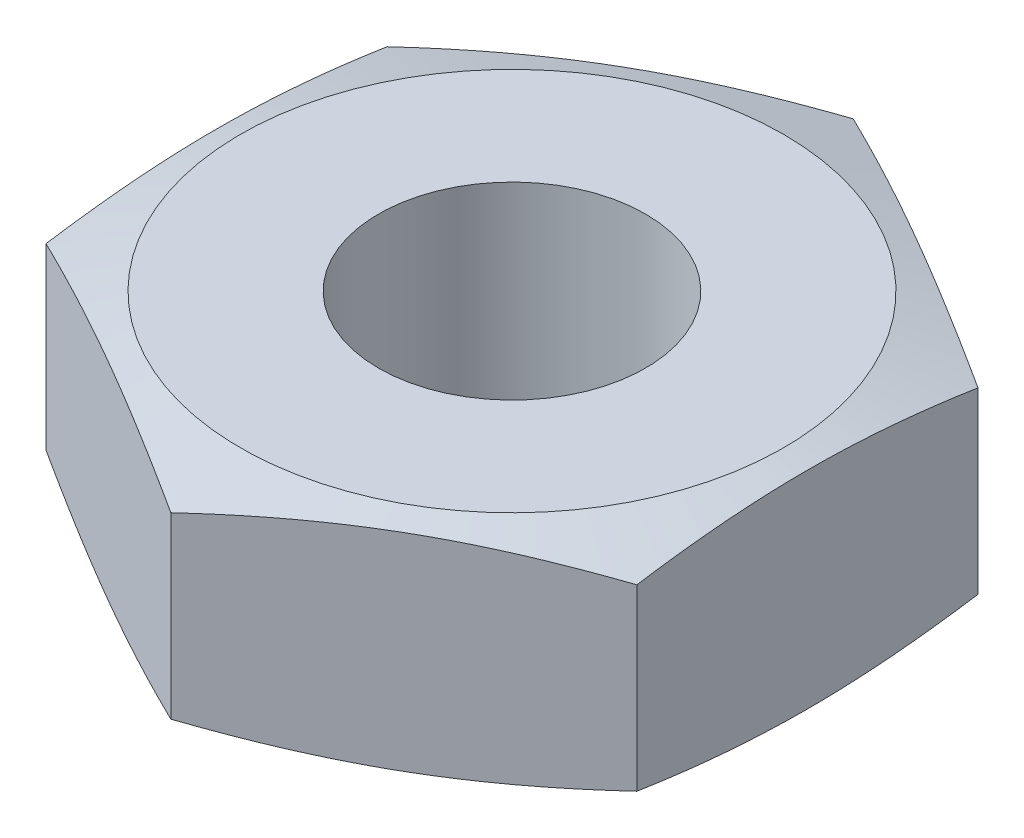
ISO-10303-21;
HEADER;
FILE_DESCRIPTION(('STEP AP214'),'2;1');
FILE_NAME('part.step','',(''),(''),'','','');
FILE_SCHEMA(('AUTOMOTIVE_DESIGN { 1 0 10303 214 1 1 1 1 }'));
ENDSEC;
DATA;
#1=APPLICATION_CONTEXT('core data for automotive mechanical design processes');
#2=APPLICATION_PROTOCOL_DEFINITION('international standard','automotive_design',2000,#1);
#3=PRODUCT_CONTEXT('',#1,'mechanical');
#4=PRODUCT('Part','Part','',(#3));
#5=PRODUCT_RELATED_PRODUCT_CATEGORY('part','',(#4));
#6=PRODUCT_DEFINITION_FORMATION('','',#4);
#7=PRODUCT_DEFINITION_CONTEXT('part definition',#1,'design');
#8=PRODUCT_DEFINITION('design','',#6,#7);
#9=PRODUCT_DEFINITION_SHAPE('','',#8);
#10=(LENGTH_UNIT() NAMED_UNIT(*) SI_UNIT(.MILLI.,.METRE.));
#11=(NAMED_UNIT(*) PLANE_ANGLE_UNIT() SI_UNIT($,.RADIAN.));
#12=(NAMED_UNIT(*) SI_UNIT($,.STERADIAN.) SOLID_ANGLE_UNIT());
#13=UNCERTAINTY_MEASURE_WITH_UNIT(LENGTH_MEASURE(1.E-05),#10,'distance_accuracy_value','');
#14=(GEOMETRIC_REPRESENTATION_CONTEXT(3) GLOBAL_UNCERTAINTY_ASSIGNED_CONTEXT((#13)) GLOBAL_UNIT_ASSIGNED_CONTEXT((#10,
#11,#12)) REPRESENTATION_CONTEXT('',''));
#15=CARTESIAN_POINT('',(0.,0.,0.));
#16=DIRECTION('',(0.,0.,1.));
#17=DIRECTION('',(1.,0.,0.));
#18=AXIS2_PLACEMENT_3D('',#15,#16,#17);
#19=CARTESIAN_POINT('',(0.,0.,0.));
#20=DIRECTION('',(0.,1.,0.));
#21=DIRECTION('',(0.,0.,1.));
#22=AXIS2_PLACEMENT_3D('',#19,#20,#21);
#23=PLANE('',#22);
#24=CARTESIAN_POINT('',(0.,0.,0.));
#25=DIRECTION('',(0.,1.,0.));
#26=DIRECTION('',(0.,0.,1.));
#27=AXIS2_PLACEMENT_3D('',#24,#25,#26);
#28=CIRCLE('',#27,1.4351);
#29=CARTESIAN_POINT('',(0.,0.,1.4351));
#30=VERTEX_POINT('',#29);
#31=EDGE_CURVE('E207',#30,#30,#28,.T.);
#32=ORIENTED_EDGE('',*,*,#31,.T.);
#33=EDGE_LOOP('',(#32));
#34=FACE_BOUND('',#33,.T.);
#35=CARTESIAN_POINT('',(0.,0.,0.));
#36=DIRECTION('',(0.,-1.,0.));
#37=DIRECTION('',(0.,0.,-1.));
#38=AXIS2_PLACEMENT_3D('',#35,#36,#37);
#39=CIRCLE('',#38,2.91823842374824);
#40=CARTESIAN_POINT('',(0.,0.,-2.91823842374824));
#41=VERTEX_POINT('',#40);
#42=EDGE_CURVE('E100',#41,#41,#39,.T.);
#43=ORIENTED_EDGE('',*,*,#42,.T.);
#44=EDGE_LOOP('',(#43));
#45=FACE_BOUND('',#44,.T.);
#46=ADVANCED_FACE('F35',(#34,#45),#23,.F.);
#47=CARTESIAN_POINT('',(0.,2.38125,0.));
#48=DIRECTION('',(0.,1.,0.));
#49=DIRECTION('',(0.,0.,1.));
#50=AXIS2_PLACEMENT_3D('',#47,#48,#49);
#51=PLANE('',#50);
#52=CARTESIAN_POINT('',(0.,2.38125,0.));
#53=DIRECTION('',(0.,1.,0.));
#54=DIRECTION('',(0.,0.,1.));
#55=AXIS2_PLACEMENT_3D('',#52,#53,#54);
#56=CIRCLE('',#55,1.4351);
#57=CARTESIAN_POINT('',(0.,2.38125,1.4351));
#58=VERTEX_POINT('',#57);
#59=EDGE_CURVE('E208',#58,#58,#56,.T.);
#60=ORIENTED_EDGE('',*,*,#59,.F.);
#61=EDGE_LOOP('',(#60));
#62=FACE_BOUND('',#61,.T.);
#63=CARTESIAN_POINT('',(0.,2.38125,0.));
#64=DIRECTION('',(0.,-1.,0.));
#65=DIRECTION('',(0.,0.,-1.));
#66=AXIS2_PLACEMENT_3D('',#63,#64,#65);
#67=CIRCLE('',#66,2.91823842374824);
#68=CARTESIAN_POINT('',(0.,2.38125,-2.91823842374824));
#69=VERTEX_POINT('',#68);
#70=EDGE_CURVE('E220',#69,#69,#67,.T.);
#71=ORIENTED_EDGE('',*,*,#70,.F.);
#72=EDGE_LOOP('',(#71));
#73=FACE_BOUND('',#72,.T.);
#74=ADVANCED_FACE('F228',(#62,#73),#51,.T.);
#75=CARTESIAN_POINT('',(-3.175,2.38125,1.83308710467706));
#76=DIRECTION('',(0.5,0.,-0.866025403784439));
#77=DIRECTION('',(-0.866025403784439,0.,-0.5));
#78=AXIS2_PLACEMENT_3D('',#75,#76,#77);
#79=PLANE('',#78);
#80=DIRECTION('',(0.,-1.,0.));
#81=VECTOR('',#80,1.);
#82=CARTESIAN_POINT('',(-3.175,2.38125,1.83308710467706));
#83=LINE('',#82,#81);
#84=CARTESIAN_POINT('',(-3.175,2.15147490433856,1.83308710467706));
#85=VERTEX_POINT('',#84);
#86=CARTESIAN_POINT('',(-3.175,0.229775095661449,1.83308710467706));
#87=VERTEX_POINT('',#86);
#88=EDGE_CURVE('E117',#85,#87,#83,.T.);
#89=ORIENTED_EDGE('',*,*,#88,.T.);
#90=CARTESIAN_POINT('',(-3.1752,0.229810571161652,1.83297163462322));
#91=CARTESIAN_POINT('',(-3.04347072029098,0.206435227969929,1.90902556972338));
#92=CARTESIAN_POINT('',(-2.91142913371932,0.185198107402909,1.98525981527476));
#93=CARTESIAN_POINT('',(-2.64673340273103,0.147867080272592,2.13808196681419));
#94=CARTESIAN_POINT('',(-2.51407896526072,0.131775965769645,2.21467004199687));
#95=CARTESIAN_POINT('',(-2.24921175176381,0.105719411660829,2.36759119900882));
#96=CARTESIAN_POINT('',(-2.11700206215993,0.0957132538636206,2.4439224988911));
#97=CARTESIAN_POINT('',(-1.85236153754915,0.0822945636551027,2.59671277701361));
#98=CARTESIAN_POINT('',(-1.71993076877457,0.0788803221892132,2.6731717170146));
#99=CARTESIAN_POINT('',(-1.45506923122543,0.0788803221892132,2.82608959701658));
#100=CARTESIAN_POINT('',(-1.32263846245085,0.0822945636551028,2.90254853701757));
#101=CARTESIAN_POINT('',(-1.05799793784007,0.0957132538636208,3.05533881514009));
#102=CARTESIAN_POINT('',(-0.925788248236195,0.105719411660829,3.13167011502237));
#103=CARTESIAN_POINT('',(-0.660921034739283,0.131775965769646,3.28459127203431));
#104=CARTESIAN_POINT('',(-0.528266597268968,0.147867080272592,3.361179347217));
#105=CARTESIAN_POINT('',(-0.263570866280681,0.18519810740291,3.51400149875643));
#106=CARTESIAN_POINT('',(-0.131529279709024,0.206435227969929,3.5902357443078));
#107=CARTESIAN_POINT('',(0.000199999999999788,0.229810571161653,3.66628967940796));
#108=B_SPLINE_CURVE_WITH_KNOTS('',3,(#90,#91,#92,#93,#94,#95,#96,#97,#98,#99,#100,#101,#102,
#103,#104,#105,#106,#107),.UNSPECIFIED.,.F.,.F.,(4,2,2,2,2,2,2,2,4),(0.,0.461713128028589,
0.923676343673619,1.38251325106804,1.84123118203172,2.2999491129954,2.75878602038983,
3.22074923603486,3.68246236406345),.UNSPECIFIED.);
#109=CARTESIAN_POINT('',(0.,0.22977509566145,3.66617420935412));
#110=VERTEX_POINT('',#109);
#111=EDGE_CURVE('E56',#87,#110,#108,.T.);
#112=ORIENTED_EDGE('',*,*,#111,.T.);
#113=DIRECTION('',(0.,-1.,0.));
#114=VECTOR('',#113,1.);
#115=CARTESIAN_POINT('',(0.,2.38125,3.66617420935412));
#116=LINE('',#115,#114);
#117=CARTESIAN_POINT('',(0.,2.15147490433856,3.66617420935412));
#118=VERTEX_POINT('',#117);
#119=EDGE_CURVE('E123',#118,#110,#116,.T.);
#120=ORIENTED_EDGE('',*,*,#119,.F.);
#121=CARTESIAN_POINT('',(0.000199999999999305,2.15143942883835,3.66628967940796));
#122=CARTESIAN_POINT('',(-0.131529279709024,2.17481477203008,3.5902357443078));
#123=CARTESIAN_POINT('',(-0.263570866280681,2.19605189259709,3.51400149875643));
#124=CARTESIAN_POINT('',(-0.528266597268968,2.23338291972741,3.361179347217));
#125=CARTESIAN_POINT('',(-0.660921034739283,2.24947403423036,3.28459127203431));
#126=CARTESIAN_POINT('',(-0.925788248236195,2.27553058833917,3.13167011502237));
#127=CARTESIAN_POINT('',(-1.05799793784007,2.28553674613638,3.05533881514009));
#128=CARTESIAN_POINT('',(-1.32263846245085,2.2989554363449,2.90254853701757));
#129=CARTESIAN_POINT('',(-1.45506923122543,2.30236967781079,2.82608959701658));
#130=CARTESIAN_POINT('',(-1.71993076877458,2.30236967781079,2.6731717170146));
#131=CARTESIAN_POINT('',(-1.85236153754915,2.2989554363449,2.59671277701361));
#132=CARTESIAN_POINT('',(-2.11700206215993,2.28553674613638,2.4439224988911));
#133=CARTESIAN_POINT('',(-2.24921175176381,2.27553058833917,2.36759119900882));
#134=CARTESIAN_POINT('',(-2.51407896526072,2.24947403423036,2.21467004199687));
#135=CARTESIAN_POINT('',(-2.64673340273103,2.23338291972741,2.13808196681419));
#136=CARTESIAN_POINT('',(-2.91142913371932,2.19605189259709,1.98525981527476));
#137=CARTESIAN_POINT('',(-3.04347072029098,2.17481477203008,1.90902556972338));
#138=CARTESIAN_POINT('',(-3.1752,2.15143942883835,1.83297163462322));
#139=B_SPLINE_CURVE_WITH_KNOTS('',3,(#121,#122,#123,#124,#125,#126,#127,#128,#129,#130,#131,
#132,#133,#134,#135,#136,#137,#138),.UNSPECIFIED.,.F.,.F.,(4,2,2,2,2,2,2,2,4),(0.,
0.46171312802859,0.923676343673619,1.38251325106804,1.84123118203172,2.2999491129954,
2.75878602038983,3.22074923603486,3.68246236406345),.UNSPECIFIED.);
#140=EDGE_CURVE('E197',#118,#85,#139,.T.);
#141=ORIENTED_EDGE('',*,*,#140,.T.);
#142=EDGE_LOOP('',(#89,#112,#120,#141));
#143=FACE_BOUND('',#142,.T.);
#144=ADVANCED_FACE('F37',(#143),#79,.F.);
#145=CARTESIAN_POINT('',(0.,2.38125,3.66617420935412));
#146=DIRECTION('',(-0.5,0.,-0.866025403784439));
#147=DIRECTION('',(-0.866025403784439,0.,0.5));
#148=AXIS2_PLACEMENT_3D('',#145,#146,#147);
#149=PLANE('',#148);
#150=ORIENTED_EDGE('',*,*,#119,.T.);
#151=CARTESIAN_POINT('',(-0.000200000000000749,0.229810571161653,3.66628967940796));
#152=CARTESIAN_POINT('',(0.131529279709023,0.206435227969929,3.5902357443078));
#153=CARTESIAN_POINT('',(0.26357086628068,0.18519810740291,3.51400149875643));
#154=CARTESIAN_POINT('',(0.528266597268967,0.147867080272592,3.361179347217));
#155=CARTESIAN_POINT('',(0.660921034739282,0.131775965769645,3.28459127203431));
#156=CARTESIAN_POINT('',(0.925788248236194,0.105719411660829,3.13167011502237));
#157=CARTESIAN_POINT('',(1.05799793784007,0.0957132538636205,3.05533881514009));
#158=CARTESIAN_POINT('',(1.32263846245085,0.0822945636551026,2.90254853701757));
#159=CARTESIAN_POINT('',(1.45506923122543,0.078880322189213,2.82608959701658));
#160=CARTESIAN_POINT('',(1.71993076877457,0.0788803221892129,2.6731717170146));
#161=CARTESIAN_POINT('',(1.85236153754915,0.0822945636551025,2.59671277701361));
#162=CARTESIAN_POINT('',(2.11700206215993,0.0957132538636203,2.44392249889109));
#163=CARTESIAN_POINT('',(2.24921175176381,0.105719411660829,2.36759119900882));
#164=CARTESIAN_POINT('',(2.51407896526072,0.131775965769645,2.21467004199687));
#165=CARTESIAN_POINT('',(2.64673340273103,0.147867080272592,2.13808196681419));
#166=CARTESIAN_POINT('',(2.91142913371932,0.185198107402909,1.98525981527475));
#167=CARTESIAN_POINT('',(3.04347072029098,0.206435227969928,1.90902556972338));
#168=CARTESIAN_POINT('',(3.1752,0.229810571161652,1.83297163462322));
#169=B_SPLINE_CURVE_WITH_KNOTS('',3,(#151,#152,#153,#154,#155,#156,#157,#158,#159,#160,#161,
#162,#163,#164,#165,#166,#167,#168),.UNSPECIFIED.,.F.,.F.,(4,2,2,2,2,2,2,2,4),(0.,
0.46171312802859,0.92367634367362,1.38251325106805,1.84123118203172,2.2999491129954,
2.75878602038983,3.22074923603486,3.68246236406345),.UNSPECIFIED.);
#170=CARTESIAN_POINT('',(3.175,0.229775095661449,1.83308710467706));
#171=VERTEX_POINT('',#170);
#172=EDGE_CURVE('E174',#110,#171,#169,.T.);
#173=ORIENTED_EDGE('',*,*,#172,.T.);
#174=DIRECTION('',(0.,-1.,0.));
#175=VECTOR('',#174,1.);
#176=CARTESIAN_POINT('',(3.175,2.38125,1.83308710467706));
#177=LINE('',#176,#175);
#178=CARTESIAN_POINT('',(3.175,2.15147490433856,1.83308710467706));
#179=VERTEX_POINT('',#178);
#180=EDGE_CURVE('E115',#179,#171,#177,.T.);
#181=ORIENTED_EDGE('',*,*,#180,.F.);
#182=CARTESIAN_POINT('',(3.1752,2.15143942883835,1.83297163462322));
#183=CARTESIAN_POINT('',(3.04347072029098,2.17481477203008,1.90902556972338));
#184=CARTESIAN_POINT('',(2.91142913371932,2.19605189259709,1.98525981527475));
#185=CARTESIAN_POINT('',(2.64673340273103,2.23338291972741,2.13808196681419));
#186=CARTESIAN_POINT('',(2.51407896526072,2.24947403423036,2.21467004199687));
#187=CARTESIAN_POINT('',(2.24921175176381,2.27553058833917,2.36759119900882));
#188=CARTESIAN_POINT('',(2.11700206215993,2.28553674613638,2.44392249889109));
#189=CARTESIAN_POINT('',(1.85236153754915,2.2989554363449,2.59671277701361));
#190=CARTESIAN_POINT('',(1.71993076877457,2.30236967781079,2.6731717170146));
#191=CARTESIAN_POINT('',(1.45506923122543,2.30236967781079,2.82608959701658));
#192=CARTESIAN_POINT('',(1.32263846245085,2.2989554363449,2.90254853701757));
#193=CARTESIAN_POINT('',(1.05799793784007,2.28553674613638,3.05533881514009));
#194=CARTESIAN_POINT('',(0.925788248236195,2.27553058833917,3.13167011502237));
#195=CARTESIAN_POINT('',(0.660921034739283,2.24947403423036,3.28459127203431));
#196=CARTESIAN_POINT('',(0.528266597268967,2.23338291972741,3.361179347217));
#197=CARTESIAN_POINT('',(0.26357086628068,2.19605189259709,3.51400149875643));
#198=CARTESIAN_POINT('',(0.131529279709024,2.17481477203008,3.5902357443078));
#199=CARTESIAN_POINT('',(-0.000199999999999806,2.15143942883835,3.66628967940796));
#200=B_SPLINE_CURVE_WITH_KNOTS('',3,(#182,#183,#184,#185,#186,#187,#188,#189,#190,#191,#192,
#193,#194,#195,#196,#197,#198,#199),.UNSPECIFIED.,.F.,.F.,(4,2,2,2,2,2,2,2,4),(0.,
0.46171312802859,0.923676343673619,1.38251325106804,1.84123118203172,2.2999491129954,
2.75878602038983,3.22074923603486,3.68246236406345),.UNSPECIFIED.);
#201=EDGE_CURVE('E190',#179,#118,#200,.T.);
#202=ORIENTED_EDGE('',*,*,#201,.T.);
#203=EDGE_LOOP('',(#150,#173,#181,#202));
#204=FACE_BOUND('',#203,.T.);
#205=ADVANCED_FACE('F182',(#204),#149,.F.);
#206=CARTESIAN_POINT('',(3.175,2.38125,1.83308710467706));
#207=DIRECTION('',(-1.,0.,0.));
#208=DIRECTION('',(0.,0.,1.));
#209=AXIS2_PLACEMENT_3D('',#206,#207,#208);
#210=PLANE('',#209);
#211=ORIENTED_EDGE('',*,*,#180,.T.);
#212=CARTESIAN_POINT('',(3.175,0.882498028858926,-4.84284838209254));
#213=CARTESIAN_POINT('',(3.175,0.845540450956629,-4.69896045540046));
#214=CARTESIAN_POINT('',(3.175,0.809028709215445,-4.55495598894786));
#215=CARTESIAN_POINT('',(3.175,0.73713997881131,-4.26665584852569));
#216=CARTESIAN_POINT('',(3.175,0.701763053935023,-4.12236015866968));
#217=CARTESIAN_POINT('',(3.175,0.632346095802565,-3.83324755787578));
#218=CARTESIAN_POINT('',(3.175,0.598307862474974,-3.68843021298746));
#219=CARTESIAN_POINT('',(3.175,0.531949077929729,-3.39840339671895));
#220=CARTESIAN_POINT('',(3.175,0.499628507893863,-3.25319392965305));
#221=CARTESIAN_POINT('',(3.175,0.437454196156556,-2.96387089117817));
#222=CARTESIAN_POINT('',(3.175,0.407577727683183,-2.81976225514172));
#223=CARTESIAN_POINT('',(3.175,0.350421882488817,-2.53103214177129));
#224=CARTESIAN_POINT('',(3.175,0.323142585134038,-2.38641064890505));
#225=CARTESIAN_POINT('',(3.175,0.246115500745554,-1.95171977178272));
#226=CARTESIAN_POINT('',(3.175,0.201160252258429,-1.66074213267588));
#227=CARTESIAN_POINT('',(3.175,0.147610508501762,-1.22030766375216));
#228=CARTESIAN_POINT('',(3.175,0.132010907382333,-1.07170073881368));
#229=CARTESIAN_POINT('',(3.175,0.106484281846803,-0.773993441648314));
#230=CARTESIAN_POINT('',(3.175,0.0965570727412833,-0.624893085646215));
#231=CARTESIAN_POINT('',(3.175,0.0829772445358877,-0.326493153784527));
#232=CARTESIAN_POINT('',(3.175,0.0793207849923239,-0.177193755942888));
#233=CARTESIAN_POINT('',(3.175,0.0785150973855896,0.121423152153427));
#234=CARTESIAN_POINT('',(3.175,0.0813658685575196,0.270740662405972));
#235=CARTESIAN_POINT('',(3.175,0.0934120979065997,0.569828401407168));
#236=CARTESIAN_POINT('',(3.175,0.102637791930309,0.71959738658901));
#237=CARTESIAN_POINT('',(3.175,0.126894565315699,1.01867337403518));
#238=CARTESIAN_POINT('',(3.175,0.141926340101328,1.16798031879835));
#239=CARTESIAN_POINT('',(3.175,0.177017570955498,1.46612406986226));
#240=CARTESIAN_POINT('',(3.175,0.197081365135513,1.6149603577177));
#241=CARTESIAN_POINT('',(3.175,0.241391749068005,1.91199750936059));
#242=CARTESIAN_POINT('',(3.175,0.265638258320237,2.06019838532089));
#243=CARTESIAN_POINT('',(3.175,0.339809615735374,2.48313370046352));
#244=CARTESIAN_POINT('',(3.175,0.393892302381207,2.7571352022586));
#245=CARTESIAN_POINT('',(3.175,0.509788370688865,3.3034975349043));
#246=CARTESIAN_POINT('',(3.175,0.571602977553403,3.57585809854592));
#247=CARTESIAN_POINT('',(3.175,0.700401117934673,4.11940090365494));
#248=CARTESIAN_POINT('',(3.175,0.767385649905057,4.39058290677428));
#249=CARTESIAN_POINT('',(3.175,0.904872680248803,4.93205405050345));
#250=CARTESIAN_POINT('',(3.175,0.975375268587398,5.2023431680914));
#251=CARTESIAN_POINT('',(3.175,1.11790589811358,5.73871832141435));
#252=CARTESIAN_POINT('',(3.175,1.18990175033281,6.00481294202591));
#253=CARTESIAN_POINT('',(3.175,1.33563742671576,6.53652945843044));
#254=CARTESIAN_POINT('',(3.175,1.40937729077384,6.80215134325982));
#255=CARTESIAN_POINT('',(3.175,1.5580369658754,7.3326419919057));
#256=CARTESIAN_POINT('',(3.175,1.63295487879459,7.59751128874055));
#257=CARTESIAN_POINT('',(3.175,1.78378297635461,8.12695565512506));
#258=CARTESIAN_POINT('',(3.175,1.85969312015137,8.39153073630235));
#259=CARTESIAN_POINT('',(3.175,1.93595574595595,8.65600298411708));
#260=B_SPLINE_CURVE_WITH_KNOTS('',3,(#212,#213,#214,#215,#216,#217,#218,#219,#220,#221,#222,
#223,#224,#225,#226,#227,#228,#229,#230,#231,#232,#233,#234,#235,#236,#237,#238,#239,#240,#241,
#242,#243,#244,#245,#246,#247,#248,#249,#250,#251,#252,#253,#254,#255,#256,#257,#258,#259),
.UNSPECIFIED.,.F.,.F.,(4,2,2,2,2,2,2,2,2,2,2,2,2,2,2,2,2,2,2,2,2,2,2,4),(0.,0.445677382769421,
0.891379772777596,1.33766225663657,1.78393985014783,2.22543420311392,2.66694204325312,
3.54970624815682,3.99788889099381,4.44605694046202,4.89395041675473,5.34184384039931,
5.79187630718249,6.24196269337618,6.6924384415769,7.14290552091956,7.98057217990627,
8.81837174439543,9.65633351768017,10.4943167306723,11.3212958977876,12.1482940004242,
12.9740738952841,13.7998199042316),.UNSPECIFIED.);
#261=CARTESIAN_POINT('',(3.175,0.229775095661447,-1.83308710467706));
#262=VERTEX_POINT('',#261);
#263=EDGE_CURVE('E110',#171,#262,#260,.F.);
#264=ORIENTED_EDGE('',*,*,#263,.T.);
#265=DIRECTION('',(0.,-1.,0.));
#266=VECTOR('',#265,1.);
#267=CARTESIAN_POINT('',(3.175,2.38125,-1.83308710467706));
#268=LINE('',#267,#266);
#269=CARTESIAN_POINT('',(3.175,2.15147490433855,-1.83308710467706));
#270=VERTEX_POINT('',#269);
#271=EDGE_CURVE('E109',#270,#262,#268,.T.);
#272=ORIENTED_EDGE('',*,*,#271,.F.);
#273=CARTESIAN_POINT('',(3.175,1.49875197114108,-4.84284838209254));
#274=CARTESIAN_POINT('',(3.175,1.53570954904337,-4.69896045540046));
#275=CARTESIAN_POINT('',(3.175,1.57222129078456,-4.55495598894786));
#276=CARTESIAN_POINT('',(3.175,1.64411002118869,-4.26665584852569));
#277=CARTESIAN_POINT('',(3.175,1.67948694606498,-4.12236015866968));
#278=CARTESIAN_POINT('',(3.175,1.74890390419744,-3.83324755787577));
#279=CARTESIAN_POINT('',(3.175,1.78294213752503,-3.68843021298746));
#280=CARTESIAN_POINT('',(3.175,1.84930092207027,-3.39840339671895));
#281=CARTESIAN_POINT('',(3.175,1.88162149210614,-3.25319392965304));
#282=CARTESIAN_POINT('',(3.175,1.94379580384345,-2.96387089117817));
#283=CARTESIAN_POINT('',(3.175,1.97367227231682,-2.81976225514172));
#284=CARTESIAN_POINT('',(3.175,2.03082811751118,-2.53103214177129));
#285=CARTESIAN_POINT('',(3.175,2.05810741486596,-2.38641064890505));
#286=CARTESIAN_POINT('',(3.175,2.13513449925445,-1.95171977178272));
#287=CARTESIAN_POINT('',(3.175,2.18008974774157,-1.66074213267588));
#288=CARTESIAN_POINT('',(3.175,2.23363949149824,-1.22030766375216));
#289=CARTESIAN_POINT('',(3.175,2.24923909261767,-1.07170073881368));
#290=CARTESIAN_POINT('',(3.175,2.2747657181532,-0.773993441648314));
#291=CARTESIAN_POINT('',(3.175,2.28469292725872,-0.624893085646215));
#292=CARTESIAN_POINT('',(3.175,2.29827275546411,-0.326493153784528));
#293=CARTESIAN_POINT('',(3.175,2.30192921500768,-0.17719375594289));
#294=CARTESIAN_POINT('',(3.175,2.30273490261441,0.121423152153425));
#295=CARTESIAN_POINT('',(3.175,2.29988413144248,0.270740662405971));
#296=CARTESIAN_POINT('',(3.175,2.2878379020934,0.569828401407167));
#297=CARTESIAN_POINT('',(3.175,2.27861220806969,0.719597386589008));
#298=CARTESIAN_POINT('',(3.175,2.2543554346843,1.01867337403517));
#299=CARTESIAN_POINT('',(3.175,2.23932365989867,1.16798031879835));
#300=CARTESIAN_POINT('',(3.175,2.20423242904451,1.46612406986226));
#301=CARTESIAN_POINT('',(3.175,2.18416863486449,1.6149603577177));
#302=CARTESIAN_POINT('',(3.175,2.139858250932,1.91199750936059));
#303=CARTESIAN_POINT('',(3.175,2.11561174167977,2.06019838532089));
#304=CARTESIAN_POINT('',(3.175,2.04144038426463,2.48313370046352));
#305=CARTESIAN_POINT('',(3.175,1.9873576976188,2.7571352022586));
#306=CARTESIAN_POINT('',(3.175,1.87146162931114,3.3034975349043));
#307=CARTESIAN_POINT('',(3.175,1.8096470224466,3.57585809854592));
#308=CARTESIAN_POINT('',(3.175,1.68084888206533,4.11940090365494));
#309=CARTESIAN_POINT('',(3.175,1.61386435009495,4.39058290677428));
#310=CARTESIAN_POINT('',(3.175,1.4763773197512,4.93205405050346));
#311=CARTESIAN_POINT('',(3.175,1.40587473141261,5.2023431680914));
#312=CARTESIAN_POINT('',(3.175,1.26334410188643,5.73871832141435));
#313=CARTESIAN_POINT('',(3.175,1.1913482496672,6.00481294202591));
#314=CARTESIAN_POINT('',(3.175,1.04561257328425,6.53652945843044));
#315=CARTESIAN_POINT('',(3.175,0.971872709226169,6.80215134325982));
#316=CARTESIAN_POINT('',(3.175,0.823213034124614,7.3326419919057));
#317=CARTESIAN_POINT('',(3.175,0.748295121205423,7.59751128874055));
#318=CARTESIAN_POINT('',(3.175,0.597467023645403,8.12695565512506));
#319=CARTESIAN_POINT('',(3.175,0.521556879848638,8.39153073630235));
#320=CARTESIAN_POINT('',(3.175,0.445294254044064,8.65600298411708));
#321=B_SPLINE_CURVE_WITH_KNOTS('',3,(#273,#274,#275,#276,#277,#278,#279,#280,#281,#282,#283,
#284,#285,#286,#287,#288,#289,#290,#291,#292,#293,#294,#295,#296,#297,#298,#299,#300,#301,#302,
#303,#304,#305,#306,#307,#308,#309,#310,#311,#312,#313,#314,#315,#316,#317,#318,#319,#320),
.UNSPECIFIED.,.F.,.F.,(4,2,2,2,2,2,2,2,2,2,2,2,2,2,2,2,2,2,2,2,2,2,2,4),(0.,0.445677382769421,
0.891379772777597,1.33766225663658,1.78393985014783,2.22543420311392,2.66694204325312,
3.54970624815682,3.99788889099381,4.44605694046202,4.89395041675472,5.34184384039931,
5.79187630718249,6.24196269337618,6.6924384415769,7.14290552091955,7.98057217990627,
8.81837174439542,9.65633351768017,10.4943167306723,11.3212958977876,12.1482940004242,
12.9740738952841,13.7998199042316),.UNSPECIFIED.);
#322=EDGE_CURVE('E198',#270,#179,#321,.T.);
#323=ORIENTED_EDGE('',*,*,#322,.T.);
#324=EDGE_LOOP('',(#211,#264,#272,#323));
#325=FACE_BOUND('',#324,.T.);
#326=ADVANCED_FACE('F185',(#325),#210,.F.);
#327=CARTESIAN_POINT('',(3.175,2.38125,-1.83308710467706));
#328=DIRECTION('',(-0.5,0.,0.866025403784439));
#329=DIRECTION('',(0.866025403784439,0.,0.5));
#330=AXIS2_PLACEMENT_3D('',#327,#328,#329);
#331=PLANE('',#330);
#332=ORIENTED_EDGE('',*,*,#271,.T.);
#333=CARTESIAN_POINT('',(3.1752,0.229810571161651,-1.83297163462322));
#334=CARTESIAN_POINT('',(3.04347072029098,0.206435227969927,-1.90902556972338));
#335=CARTESIAN_POINT('',(2.91142913371932,0.185198107402908,-1.98525981527476));
#336=CARTESIAN_POINT('',(2.64673340273103,0.14786708027259,-2.13808196681419));
#337=CARTESIAN_POINT('',(2.51407896526072,0.131775965769643,-2.21467004199687));
#338=CARTESIAN_POINT('',(2.24921175176381,0.105719411660827,-2.36759119900882));
#339=CARTESIAN_POINT('',(2.11700206215993,0.0957132538636186,-2.4439224988911));
#340=CARTESIAN_POINT('',(1.85236153754915,0.0822945636551006,-2.59671277701361));
#341=CARTESIAN_POINT('',(1.71993076877457,0.0788803221892111,-2.6731717170146));
#342=CARTESIAN_POINT('',(1.45506923122543,0.0788803221892111,-2.82608959701658));
#343=CARTESIAN_POINT('',(1.32263846245085,0.0822945636551007,-2.90254853701757));
#344=CARTESIAN_POINT('',(1.05799793784007,0.0957132538636185,-3.05533881514009));
#345=CARTESIAN_POINT('',(0.925788248236194,0.105719411660827,-3.13167011502237));
#346=CARTESIAN_POINT('',(0.660921034739282,0.131775965769643,-3.28459127203431));
#347=CARTESIAN_POINT('',(0.528266597268966,0.14786708027259,-3.361179347217));
#348=CARTESIAN_POINT('',(0.26357086628068,0.185198107402907,-3.51400149875643));
#349=CARTESIAN_POINT('',(0.131529279709023,0.206435227969927,-3.5902357443078));
#350=CARTESIAN_POINT('',(-0.000200000000000284,0.22981057116165,-3.66628967940796));
#351=B_SPLINE_CURVE_WITH_KNOTS('',3,(#333,#334,#335,#336,#337,#338,#339,#340,#341,#342,#343,
#344,#345,#346,#347,#348,#349,#350),.UNSPECIFIED.,.F.,.F.,(4,2,2,2,2,2,2,2,4),(0.,
0.46171312802859,0.923676343673619,1.38251325106804,1.84123118203172,2.2999491129954,
2.75878602038983,3.22074923603486,3.68246236406345),.UNSPECIFIED.);
#352=CARTESIAN_POINT('',(0.,0.229775095661447,-3.66617420935412));
#353=VERTEX_POINT('',#352);
#354=EDGE_CURVE('E94',#262,#353,#351,.T.);
#355=ORIENTED_EDGE('',*,*,#354,.T.);
#356=DIRECTION('',(0.,-1.,0.));
#357=VECTOR('',#356,1.);
#358=CARTESIAN_POINT('',(0.,2.38125,-3.66617420935412));
#359=LINE('',#358,#357);
#360=CARTESIAN_POINT('',(0.,2.15147490433855,-3.66617420935412));
#361=VERTEX_POINT('',#360);
#362=EDGE_CURVE('E107',#361,#353,#359,.T.);
#363=ORIENTED_EDGE('',*,*,#362,.F.);
#364=CARTESIAN_POINT('',(-0.000199999999999995,2.15143942883835,-3.66628967940796));
#365=CARTESIAN_POINT('',(0.131529279709023,2.17481477203007,-3.5902357443078));
#366=CARTESIAN_POINT('',(0.26357086628068,2.19605189259709,-3.51400149875643));
#367=CARTESIAN_POINT('',(0.528266597268967,2.23338291972741,-3.361179347217));
#368=CARTESIAN_POINT('',(0.660921034739282,2.24947403423036,-3.28459127203431));
#369=CARTESIAN_POINT('',(0.925788248236194,2.27553058833917,-3.13167011502237));
#370=CARTESIAN_POINT('',(1.05799793784007,2.28553674613638,-3.05533881514009));
#371=CARTESIAN_POINT('',(1.32263846245085,2.2989554363449,-2.90254853701757));
#372=CARTESIAN_POINT('',(1.45506923122543,2.30236967781079,-2.82608959701658));
#373=CARTESIAN_POINT('',(1.71993076877457,2.30236967781079,-2.6731717170146));
#374=CARTESIAN_POINT('',(1.85236153754915,2.2989554363449,-2.59671277701361));
#375=CARTESIAN_POINT('',(2.11700206215993,2.28553674613638,-2.4439224988911));
#376=CARTESIAN_POINT('',(2.24921175176381,2.27553058833917,-2.36759119900882));
#377=CARTESIAN_POINT('',(2.51407896526072,2.24947403423036,-2.21467004199687));
#378=CARTESIAN_POINT('',(2.64673340273103,2.23338291972741,-2.13808196681419));
#379=CARTESIAN_POINT('',(2.91142913371932,2.19605189259709,-1.98525981527476));
#380=CARTESIAN_POINT('',(3.04347072029098,2.17481477203007,-1.90902556972338));
#381=CARTESIAN_POINT('',(3.1752,2.15143942883835,-1.83297163462322));
#382=B_SPLINE_CURVE_WITH_KNOTS('',3,(#364,#365,#366,#367,#368,#369,#370,#371,#372,#373,#374,
#375,#376,#377,#378,#379,#380,#381),.UNSPECIFIED.,.F.,.F.,(4,2,2,2,2,2,2,2,4),(0.,
0.461713128028589,0.923676343673618,1.38251325106804,1.84123118203172,2.2999491129954,
2.75878602038983,3.22074923603486,3.68246236406345),.UNSPECIFIED.);
#383=EDGE_CURVE('E219',#361,#270,#382,.T.);
#384=ORIENTED_EDGE('',*,*,#383,.T.);
#385=EDGE_LOOP('',(#332,#355,#363,#384));
#386=FACE_BOUND('',#385,.T.);
#387=ADVANCED_FACE('F105',(#386),#331,.F.);
#388=CARTESIAN_POINT('',(0.,2.38125,-3.66617420935412));
#389=DIRECTION('',(0.5,0.,0.866025403784439));
#390=DIRECTION('',(0.866025403784439,0.,-0.5));
#391=AXIS2_PLACEMENT_3D('',#388,#389,#390);
#392=PLANE('',#391);
#393=ORIENTED_EDGE('',*,*,#362,.T.);
#394=CARTESIAN_POINT('',(0.000200000000000058,0.22981057116165,-3.66628967940796));
#395=CARTESIAN_POINT('',(-0.131529279709024,0.206435227969926,-3.5902357443078));
#396=CARTESIAN_POINT('',(-0.263570866280681,0.185198107402907,-3.51400149875643));
#397=CARTESIAN_POINT('',(-0.528266597268967,0.14786708027259,-3.361179347217));
#398=CARTESIAN_POINT('',(-0.660921034739282,0.131775965769643,-3.28459127203431));
#399=CARTESIAN_POINT('',(-0.925788248236194,0.105719411660827,-3.13167011502237));
#400=CARTESIAN_POINT('',(-1.05799793784007,0.0957132538636186,-3.05533881514009));
#401=CARTESIAN_POINT('',(-1.32263846245085,0.0822945636551007,-2.90254853701757));
#402=CARTESIAN_POINT('',(-1.45506923122543,0.0788803221892111,-2.82608959701658));
#403=CARTESIAN_POINT('',(-1.71993076877457,0.078880322189211,-2.6731717170146));
#404=CARTESIAN_POINT('',(-1.85236153754915,0.0822945636551006,-2.59671277701361));
#405=CARTESIAN_POINT('',(-2.11700206215993,0.0957132538636187,-2.4439224988911));
#406=CARTESIAN_POINT('',(-2.24921175176381,0.105719411660827,-2.36759119900882));
#407=CARTESIAN_POINT('',(-2.51407896526072,0.131775965769644,-2.21467004199687));
#408=CARTESIAN_POINT('',(-2.64673340273103,0.14786708027259,-2.13808196681419));
#409=CARTESIAN_POINT('',(-2.91142913371932,0.185198107402908,-1.98525981527476));
#410=CARTESIAN_POINT('',(-3.04347072029098,0.206435227969927,-1.90902556972338));
#411=CARTESIAN_POINT('',(-3.1752,0.229810571161651,-1.83297163462322));
#412=B_SPLINE_CURVE_WITH_KNOTS('',3,(#394,#395,#396,#397,#398,#399,#400,#401,#402,#403,#404,
#405,#406,#407,#408,#409,#410,#411),.UNSPECIFIED.,.F.,.F.,(4,2,2,2,2,2,2,2,4),(0.,
0.46171312802859,0.923676343673619,1.38251325106804,1.84123118203172,2.2999491129954,
2.75878602038983,3.22074923603486,3.68246236406345),.UNSPECIFIED.);
#413=CARTESIAN_POINT('',(-3.175,0.229775095661447,-1.83308710467706));
#414=VERTEX_POINT('',#413);
#415=EDGE_CURVE('E91',#353,#414,#412,.T.);
#416=ORIENTED_EDGE('',*,*,#415,.T.);
#417=DIRECTION('',(0.,-1.,0.));
#418=VECTOR('',#417,1.);
#419=CARTESIAN_POINT('',(-3.175,2.38125,-1.83308710467706));
#420=LINE('',#419,#418);
#421=CARTESIAN_POINT('',(-3.175,2.15147490433855,-1.83308710467706));
#422=VERTEX_POINT('',#421);
#423=EDGE_CURVE('E113',#422,#414,#420,.T.);
#424=ORIENTED_EDGE('',*,*,#423,.F.);
#425=CARTESIAN_POINT('',(-3.1752,2.15143942883835,-1.83297163462322));
#426=CARTESIAN_POINT('',(-3.04347072029098,2.17481477203007,-1.90902556972338));
#427=CARTESIAN_POINT('',(-2.91142913371932,2.19605189259709,-1.98525981527476));
#428=CARTESIAN_POINT('',(-2.64673340273103,2.23338291972741,-2.13808196681419));
#429=CARTESIAN_POINT('',(-2.51407896526072,2.24947403423036,-2.21467004199687));
#430=CARTESIAN_POINT('',(-2.24921175176381,2.27553058833917,-2.36759119900882));
#431=CARTESIAN_POINT('',(-2.11700206215993,2.28553674613638,-2.4439224988911));
#432=CARTESIAN_POINT('',(-1.85236153754915,2.2989554363449,-2.59671277701361));
#433=CARTESIAN_POINT('',(-1.71993076877457,2.30236967781079,-2.6731717170146));
#434=CARTESIAN_POINT('',(-1.45506923122543,2.30236967781079,-2.82608959701658));
#435=CARTESIAN_POINT('',(-1.32263846245085,2.2989554363449,-2.90254853701757));
#436=CARTESIAN_POINT('',(-1.05799793784007,2.28553674613638,-3.05533881514009));
#437=CARTESIAN_POINT('',(-0.925788248236194,2.27553058833917,-3.13167011502237));
#438=CARTESIAN_POINT('',(-0.660921034739282,2.24947403423036,-3.28459127203431));
#439=CARTESIAN_POINT('',(-0.528266597268967,2.23338291972741,-3.361179347217));
#440=CARTESIAN_POINT('',(-0.26357086628068,2.19605189259709,-3.51400149875643));
#441=CARTESIAN_POINT('',(-0.131529279709023,2.17481477203007,-3.5902357443078));
#442=CARTESIAN_POINT('',(0.000200000000000677,2.15143942883835,-3.66628967940796));
#443=B_SPLINE_CURVE_WITH_KNOTS('',3,(#425,#426,#427,#428,#429,#430,#431,#432,#433,#434,#435,
#436,#437,#438,#439,#440,#441,#442),.UNSPECIFIED.,.F.,.F.,(4,2,2,2,2,2,2,2,4),(0.,
0.461713128028589,0.923676343673618,1.38251325106804,1.84123118203172,2.2999491129954,
2.75878602038983,3.22074923603486,3.68246236406345),.UNSPECIFIED.);
#444=EDGE_CURVE('E63',#422,#361,#443,.T.);
#445=ORIENTED_EDGE('',*,*,#444,.T.);
#446=EDGE_LOOP('',(#393,#416,#424,#445));
#447=FACE_BOUND('',#446,.T.);
#448=ADVANCED_FACE('F112',(#447),#392,.F.);
#449=CARTESIAN_POINT('',(-3.175,2.38125,-1.83308710467706));
#450=DIRECTION('',(1.,0.,0.));
#451=DIRECTION('',(0.,0.,-1.));
#452=AXIS2_PLACEMENT_3D('',#449,#450,#451);
#453=PLANE('',#452);
#454=ORIENTED_EDGE('',*,*,#423,.T.);
#455=CARTESIAN_POINT('',(-3.175,0.882498028858926,-4.84284838209254));
#456=CARTESIAN_POINT('',(-3.175,0.845540450956629,-4.69896045540046));
#457=CARTESIAN_POINT('',(-3.175,0.809028709215445,-4.55495598894786));
#458=CARTESIAN_POINT('',(-3.175,0.73713997881131,-4.26665584852569));
#459=CARTESIAN_POINT('',(-3.175,0.701763053935023,-4.12236015866968));
#460=CARTESIAN_POINT('',(-3.175,0.632346095802565,-3.83324755787577));
#461=CARTESIAN_POINT('',(-3.175,0.598307862474975,-3.68843021298746));
#462=CARTESIAN_POINT('',(-3.175,0.53194907792973,-3.39840339671895));
#463=CARTESIAN_POINT('',(-3.175,0.499628507893863,-3.25319392965305));
#464=CARTESIAN_POINT('',(-3.175,0.437454196156556,-2.96387089117817));
#465=CARTESIAN_POINT('',(-3.175,0.407577727683184,-2.81976225514172));
#466=CARTESIAN_POINT('',(-3.175,0.350421882488817,-2.53103214177129));
#467=CARTESIAN_POINT('',(-3.175,0.323142585134038,-2.38641064890505));
#468=CARTESIAN_POINT('',(-3.175,0.246115500745554,-1.95171977178272));
#469=CARTESIAN_POINT('',(-3.175,0.201160252258429,-1.66074213267588));
#470=CARTESIAN_POINT('',(-3.175,0.147610508501762,-1.22030766375216));
#471=CARTESIAN_POINT('',(-3.175,0.132010907382334,-1.07170073881368));
#472=CARTESIAN_POINT('',(-3.175,0.106484281846803,-0.773993441648313));
#473=CARTESIAN_POINT('',(-3.175,0.0965570727412835,-0.624893085646214));
#474=CARTESIAN_POINT('',(-3.175,0.0829772445358878,-0.326493153784527));
#475=CARTESIAN_POINT('',(-3.175,0.079320784992324,-0.177193755942888));
#476=CARTESIAN_POINT('',(-3.175,0.0785150973855898,0.121423152153427));
#477=CARTESIAN_POINT('',(-3.175,0.0813658685575198,0.270740662405973));
#478=CARTESIAN_POINT('',(-3.175,0.0934120979065999,0.569828401407169));
#479=CARTESIAN_POINT('',(-3.175,0.102637791930309,0.719597386589011));
#480=CARTESIAN_POINT('',(-3.175,0.126894565315699,1.01867337403518));
#481=CARTESIAN_POINT('',(-3.175,0.141926340101328,1.16798031879835));
#482=CARTESIAN_POINT('',(-3.175,0.177017570955498,1.46612406986226));
#483=CARTESIAN_POINT('',(-3.175,0.197081365135513,1.6149603577177));
#484=CARTESIAN_POINT('',(-3.175,0.241391749068005,1.91199750936059));
#485=CARTESIAN_POINT('',(-3.175,0.265638258320237,2.06019838532089));
#486=CARTESIAN_POINT('',(-3.175,0.339809615735374,2.48313370046352));
#487=CARTESIAN_POINT('',(-3.175,0.393892302381208,2.7571352022586));
#488=CARTESIAN_POINT('',(-3.175,0.509788370688865,3.3034975349043));
#489=CARTESIAN_POINT('',(-3.175,0.571602977553404,3.57585809854592));
#490=CARTESIAN_POINT('',(-3.175,0.700401117934673,4.11940090365494));
#491=CARTESIAN_POINT('',(-3.175,0.767385649905057,4.39058290677428));
#492=CARTESIAN_POINT('',(-3.175,0.904872680248803,4.93205405050346));
#493=CARTESIAN_POINT('',(-3.175,0.975375268587399,5.2023431680914));
#494=CARTESIAN_POINT('',(-3.175,1.11790589811358,5.73871832141435));
#495=CARTESIAN_POINT('',(-3.175,1.18990175033281,6.00481294202591));
#496=CARTESIAN_POINT('',(-3.175,1.33563742671576,6.53652945843045));
#497=CARTESIAN_POINT('',(-3.175,1.40937729077384,6.80215134325982));
#498=CARTESIAN_POINT('',(-3.175,1.5580369658754,7.3326419919057));
#499=CARTESIAN_POINT('',(-3.175,1.63295487879459,7.59751128874055));
#500=CARTESIAN_POINT('',(-3.175,1.78378297635461,8.12695565512506));
#501=CARTESIAN_POINT('',(-3.175,1.85969312015137,8.39153073630235));
#502=CARTESIAN_POINT('',(-3.175,1.93595574595595,8.65600298411708));
#503=B_SPLINE_CURVE_WITH_KNOTS('',3,(#455,#456,#457,#458,#459,#460,#461,#462,#463,#464,#465,
#466,#467,#468,#469,#470,#471,#472,#473,#474,#475,#476,#477,#478,#479,#480,#481,#482,#483,#484,
#485,#486,#487,#488,#489,#490,#491,#492,#493,#494,#495,#496,#497,#498,#499,#500,#501,#502),
.UNSPECIFIED.,.F.,.F.,(4,2,2,2,2,2,2,2,2,2,2,2,2,2,2,2,2,2,2,2,2,2,2,4),(0.,0.44567738276942,
0.891379772777596,1.33766225663657,1.78393985014783,2.22543420311392,2.66694204325312,
3.54970624815682,3.99788889099381,4.44605694046202,4.89395041675473,5.34184384039931,
5.7918763071825,6.24196269337618,6.6924384415769,7.14290552091956,7.98057217990627,
8.81837174439543,9.65633351768017,10.4943167306723,11.3212958977876,12.1482940004242,
12.9740738952841,13.7998199042316),.UNSPECIFIED.);
#504=EDGE_CURVE('E11',#414,#87,#503,.T.);
#505=ORIENTED_EDGE('',*,*,#504,.T.);
#506=ORIENTED_EDGE('',*,*,#88,.F.);
#507=CARTESIAN_POINT('',(-3.175,1.49875197114107,-4.84284838209254));
#508=CARTESIAN_POINT('',(-3.175,1.53570954904337,-4.69896045540046));
#509=CARTESIAN_POINT('',(-3.175,1.57222129078456,-4.55495598894786));
#510=CARTESIAN_POINT('',(-3.175,1.64411002118869,-4.26665584852569));
#511=CARTESIAN_POINT('',(-3.175,1.67948694606498,-4.12236015866968));
#512=CARTESIAN_POINT('',(-3.175,1.74890390419744,-3.83324755787577));
#513=CARTESIAN_POINT('',(-3.175,1.78294213752503,-3.68843021298746));
#514=CARTESIAN_POINT('',(-3.175,1.84930092207027,-3.39840339671895));
#515=CARTESIAN_POINT('',(-3.175,1.88162149210614,-3.25319392965305));
#516=CARTESIAN_POINT('',(-3.175,1.94379580384344,-2.96387089117817));
#517=CARTESIAN_POINT('',(-3.175,1.97367227231682,-2.81976225514172));
#518=CARTESIAN_POINT('',(-3.175,2.03082811751118,-2.53103214177129));
#519=CARTESIAN_POINT('',(-3.175,2.05810741486596,-2.38641064890505));
#520=CARTESIAN_POINT('',(-3.175,2.13513449925445,-1.95171977178272));
#521=CARTESIAN_POINT('',(-3.175,2.18008974774157,-1.66074213267588));
#522=CARTESIAN_POINT('',(-3.175,2.23363949149824,-1.22030766375216));
#523=CARTESIAN_POINT('',(-3.175,2.24923909261767,-1.07170073881368));
#524=CARTESIAN_POINT('',(-3.175,2.2747657181532,-0.773993441648313));
#525=CARTESIAN_POINT('',(-3.175,2.28469292725872,-0.624893085646214));
#526=CARTESIAN_POINT('',(-3.175,2.29827275546411,-0.326493153784527));
#527=CARTESIAN_POINT('',(-3.175,2.30192921500768,-0.177193755942888));
#528=CARTESIAN_POINT('',(-3.175,2.30273490261441,0.121423152153427));
#529=CARTESIAN_POINT('',(-3.175,2.29988413144248,0.270740662405972));
#530=CARTESIAN_POINT('',(-3.175,2.2878379020934,0.569828401407168));
#531=CARTESIAN_POINT('',(-3.175,2.27861220806969,0.71959738658901));
#532=CARTESIAN_POINT('',(-3.175,2.2543554346843,1.01867337403518));
#533=CARTESIAN_POINT('',(-3.175,2.23932365989867,1.16798031879835));
#534=CARTESIAN_POINT('',(-3.175,2.20423242904451,1.46612406986226));
#535=CARTESIAN_POINT('',(-3.175,2.18416863486449,1.6149603577177));
#536=CARTESIAN_POINT('',(-3.175,2.139858250932,1.91199750936059));
#537=CARTESIAN_POINT('',(-3.175,2.11561174167977,2.06019838532089));
#538=CARTESIAN_POINT('',(-3.175,2.04144038426463,2.48313370046352));
#539=CARTESIAN_POINT('',(-3.175,1.9873576976188,2.7571352022586));
#540=CARTESIAN_POINT('',(-3.175,1.87146162931114,3.3034975349043));
#541=CARTESIAN_POINT('',(-3.175,1.8096470224466,3.57585809854592));
#542=CARTESIAN_POINT('',(-3.175,1.68084888206533,4.11940090365493));
#543=CARTESIAN_POINT('',(-3.175,1.61386435009495,4.39058290677427));
#544=CARTESIAN_POINT('',(-3.175,1.47637731975121,4.93205405050345));
#545=CARTESIAN_POINT('',(-3.175,1.40587473141261,5.2023431680914));
#546=CARTESIAN_POINT('',(-3.175,1.26334410188643,5.73871832141434));
#547=CARTESIAN_POINT('',(-3.175,1.1913482496672,6.00481294202591));
#548=CARTESIAN_POINT('',(-3.175,1.04561257328425,6.53652945843044));
#549=CARTESIAN_POINT('',(-3.175,0.971872709226171,6.80215134325981));
#550=CARTESIAN_POINT('',(-3.175,0.823213034124615,7.3326419919057));
#551=CARTESIAN_POINT('',(-3.175,0.748295121205424,7.59751128874055));
#552=CARTESIAN_POINT('',(-3.175,0.597467023645403,8.12695565512506));
#553=CARTESIAN_POINT('',(-3.175,0.521556879848638,8.39153073630235));
#554=CARTESIAN_POINT('',(-3.175,0.445294254044064,8.65600298411708));
#555=B_SPLINE_CURVE_WITH_KNOTS('',3,(#507,#508,#509,#510,#511,#512,#513,#514,#515,#516,#517,
#518,#519,#520,#521,#522,#523,#524,#525,#526,#527,#528,#529,#530,#531,#532,#533,#534,#535,#536,
#537,#538,#539,#540,#541,#542,#543,#544,#545,#546,#547,#548,#549,#550,#551,#552,#553,#554),
.UNSPECIFIED.,.F.,.F.,(4,2,2,2,2,2,2,2,2,2,2,2,2,2,2,2,2,2,2,2,2,2,2,4),(0.,0.44567738276942,
0.891379772777595,1.33766225663657,1.78393985014783,2.22543420311392,2.66694204325312,
3.54970624815682,3.99788889099381,4.44605694046202,4.89395041675473,5.34184384039931,
5.79187630718249,6.24196269337618,6.6924384415769,7.14290552091955,7.98057217990626,
8.81837174439542,9.65633351768016,10.4943167306723,11.3212958977876,12.1482940004242,
12.9740738952841,13.7998199042316),.UNSPECIFIED.);
#556=EDGE_CURVE('E49',#85,#422,#555,.F.);
#557=ORIENTED_EDGE('',*,*,#556,.T.);
#558=EDGE_LOOP('',(#454,#505,#506,#557));
#559=FACE_BOUND('',#558,.T.);
#560=ADVANCED_FACE('F132',(#559),#453,.F.);
#561=CARTESIAN_POINT('',(0.,2.38125,0.));
#562=DIRECTION('',(0.,-1.,0.));
#563=DIRECTION('',(0.,0.,-1.));
#564=AXIS2_PLACEMENT_3D('',#561,#562,#563);
#565=CYLINDRICAL_SURFACE('',#564,1.4351);
#566=ORIENTED_EDGE('',*,*,#59,.T.);
#567=EDGE_LOOP('',(#566));
#568=FACE_BOUND('',#567,.T.);
#569=ORIENTED_EDGE('',*,*,#31,.F.);
#570=EDGE_LOOP('',(#569));
#571=FACE_BOUND('',#570,.T.);
#572=ADVANCED_FACE('F137',(#568,#571),#565,.F.);
#573=CARTESIAN_POINT('',(0.,2.38125,0.));
#574=DIRECTION('',(0.,-1.,0.));
#575=DIRECTION('',(0.,0.,-1.));
#576=AXIS2_PLACEMENT_3D('',#573,#574,#575);
#577=CONICAL_SURFACE('',#576,2.91823842374824,1.27273592011525);
#578=ORIENTED_EDGE('',*,*,#70,.T.);
#579=EDGE_LOOP('',(#578));
#580=FACE_BOUND('',#579,.T.);
#581=ORIENTED_EDGE('',*,*,#201,.F.);
#582=ORIENTED_EDGE('',*,*,#322,.F.);
#583=ORIENTED_EDGE('',*,*,#383,.F.);
#584=ORIENTED_EDGE('',*,*,#444,.F.);
#585=ORIENTED_EDGE('',*,*,#556,.F.);
#586=ORIENTED_EDGE('',*,*,#140,.F.);
#587=EDGE_LOOP('',(#581,#582,#583,#584,#585,#586));
#588=FACE_BOUND('',#587,.T.);
#589=ADVANCED_FACE('F129',(#580,#588),#577,.T.);
#590=CARTESIAN_POINT('',(0.,0.229775095661448,0.));
#591=DIRECTION('',(0.,1.,0.));
#592=DIRECTION('',(0.,0.,1.));
#593=AXIS2_PLACEMENT_3D('',#590,#591,#592);
#594=CONICAL_SURFACE('',#593,3.66617420935412,1.27273592011525);
#595=ORIENTED_EDGE('',*,*,#42,.F.);
#596=EDGE_LOOP('',(#595));
#597=FACE_BOUND('',#596,.T.);
#598=ORIENTED_EDGE('',*,*,#504,.F.);
#599=ORIENTED_EDGE('',*,*,#415,.F.);
#600=ORIENTED_EDGE('',*,*,#354,.F.);
#601=ORIENTED_EDGE('',*,*,#263,.F.);
#602=ORIENTED_EDGE('',*,*,#172,.F.);
#603=ORIENTED_EDGE('',*,*,#111,.F.);
#604=EDGE_LOOP('',(#598,#599,#600,#601,#602,#603));
#605=FACE_BOUND('',#604,.T.);
#606=ADVANCED_FACE('F93',(#597,#605),#594,.T.);
#607=CLOSED_SHELL('',(#46,#74,#144,#205,#326,#387,#448,#560,#572,#589,#606));
#608=MANIFOLD_SOLID_BREP('B2',#607);
#609=ADVANCED_BREP_SHAPE_REPRESENTATION('',(#18,#608),#14);
#610=SHAPE_DEFINITION_REPRESENTATION(#9,#609);
ENDSEC;
END-ISO-10303-21;
